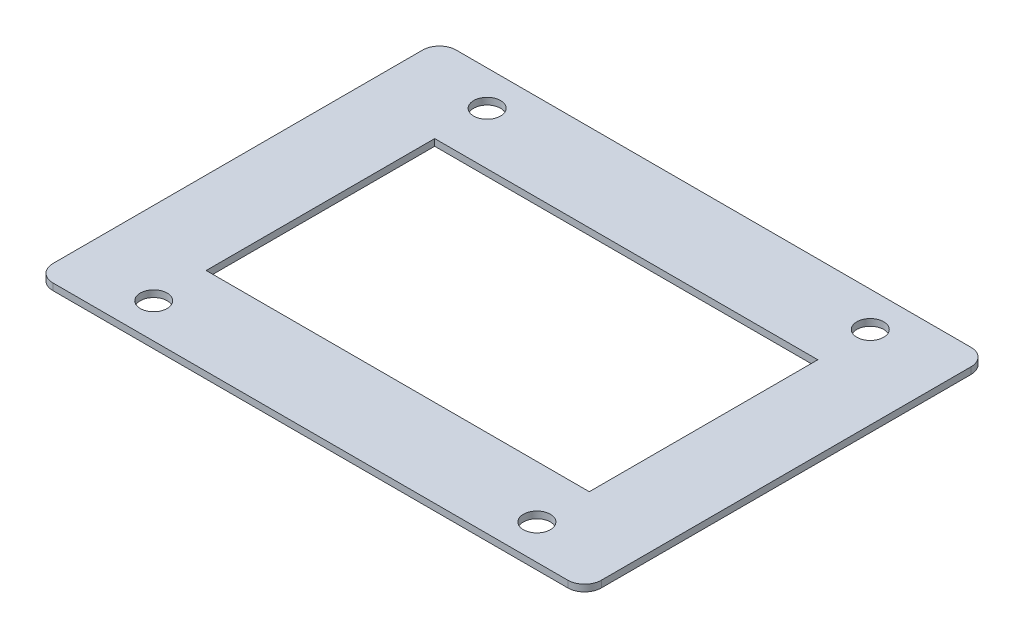
ISO-10303-21;
HEADER;
FILE_DESCRIPTION(('STEP AP214'),'2;1');
FILE_NAME('part.step','',(''),(''),'','','');
FILE_SCHEMA(('AUTOMOTIVE_DESIGN { 1 0 10303 214 1 1 1 1 }'));
ENDSEC;
DATA;
#1=APPLICATION_CONTEXT('core data for automotive mechanical design processes');
#2=APPLICATION_PROTOCOL_DEFINITION('international standard','automotive_design',2000,#1);
#3=PRODUCT_CONTEXT('',#1,'mechanical');
#4=PRODUCT('Part','Part','',(#3));
#5=PRODUCT_RELATED_PRODUCT_CATEGORY('part','',(#4));
#6=PRODUCT_DEFINITION_FORMATION('','',#4);
#7=PRODUCT_DEFINITION_CONTEXT('part definition',#1,'design');
#8=PRODUCT_DEFINITION('design','',#6,#7);
#9=PRODUCT_DEFINITION_SHAPE('','',#8);
#10=(LENGTH_UNIT() NAMED_UNIT(*) SI_UNIT(.MILLI.,.METRE.));
#11=(NAMED_UNIT(*) PLANE_ANGLE_UNIT() SI_UNIT($,.RADIAN.));
#12=(NAMED_UNIT(*) SI_UNIT($,.STERADIAN.) SOLID_ANGLE_UNIT());
#13=UNCERTAINTY_MEASURE_WITH_UNIT(LENGTH_MEASURE(1.E-05),#10,'distance_accuracy_value','');
#14=(GEOMETRIC_REPRESENTATION_CONTEXT(3) GLOBAL_UNCERTAINTY_ASSIGNED_CONTEXT((#13)) GLOBAL_UNIT_ASSIGNED_CONTEXT((#10,
#11,#12)) REPRESENTATION_CONTEXT('',''));
#15=CARTESIAN_POINT('',(0.,0.,0.));
#16=DIRECTION('',(0.,0.,1.));
#17=DIRECTION('',(1.,0.,0.));
#18=AXIS2_PLACEMENT_3D('',#15,#16,#17);
#19=CARTESIAN_POINT('',(38.3,1.,-27.5));
#20=DIRECTION('',(0.,1.,0.));
#21=DIRECTION('',(0.,0.,1.));
#22=AXIS2_PLACEMENT_3D('',#19,#20,#21);
#23=PLANE('',#22);
#24=CARTESIAN_POINT('',(-28.5,1.,-24.8));
#25=DIRECTION('',(0.,1.,0.));
#26=DIRECTION('',(0.,0.,1.));
#27=AXIS2_PLACEMENT_3D('',#24,#25,#26);
#28=CIRCLE('',#27,2.);
#29=CARTESIAN_POINT('',(-28.5,1.,-22.8));
#30=VERTEX_POINT('',#29);
#31=EDGE_CURVE('E163',#30,#30,#28,.T.);
#32=ORIENTED_EDGE('',*,*,#31,.F.);
#33=EDGE_LOOP('',(#32));
#34=FACE_BOUND('',#33,.T.);
#35=CARTESIAN_POINT('',(28.5,1.,24.8));
#36=DIRECTION('',(0.,1.,0.));
#37=DIRECTION('',(0.,0.,1.));
#38=AXIS2_PLACEMENT_3D('',#35,#36,#37);
#39=CIRCLE('',#38,2.);
#40=CARTESIAN_POINT('',(28.5,1.,26.8));
#41=VERTEX_POINT('',#40);
#42=EDGE_CURVE('E175',#41,#41,#39,.T.);
#43=ORIENTED_EDGE('',*,*,#42,.F.);
#44=EDGE_LOOP('',(#43));
#45=FACE_BOUND('',#44,.T.);
#46=CARTESIAN_POINT('',(38.3,1.,-27.5));
#47=DIRECTION('',(0.,1.,0.));
#48=DIRECTION('',(0.,0.,1.));
#49=AXIS2_PLACEMENT_3D('',#46,#47,#48);
#50=CIRCLE('',#49,2.5);
#51=CARTESIAN_POINT('',(40.8,1.,-27.5));
#52=VERTEX_POINT('',#51);
#53=CARTESIAN_POINT('',(38.3,1.,-30.));
#54=VERTEX_POINT('',#53);
#55=EDGE_CURVE('E181',#52,#54,#50,.T.);
#56=ORIENTED_EDGE('',*,*,#55,.T.);
#57=DIRECTION('',(-1.,0.,0.));
#58=VECTOR('',#57,1.);
#59=CARTESIAN_POINT('',(-38.3,1.,-30.));
#60=LINE('',#59,#58);
#61=CARTESIAN_POINT('',(-38.3,1.,-30.));
#62=VERTEX_POINT('',#61);
#63=EDGE_CURVE('E184',#54,#62,#60,.T.);
#64=ORIENTED_EDGE('',*,*,#63,.T.);
#65=CARTESIAN_POINT('',(-38.3,1.,-27.5));
#66=DIRECTION('',(0.,1.,0.));
#67=DIRECTION('',(0.,0.,1.));
#68=AXIS2_PLACEMENT_3D('',#65,#66,#67);
#69=CIRCLE('',#68,2.5);
#70=CARTESIAN_POINT('',(-40.8,1.,-27.5));
#71=VERTEX_POINT('',#70);
#72=EDGE_CURVE('E187',#62,#71,#69,.T.);
#73=ORIENTED_EDGE('',*,*,#72,.T.);
#74=DIRECTION('',(0.,0.,1.));
#75=VECTOR('',#74,1.);
#76=CARTESIAN_POINT('',(-40.8,1.,27.5));
#77=LINE('',#76,#75);
#78=CARTESIAN_POINT('',(-40.8,1.,27.5));
#79=VERTEX_POINT('',#78);
#80=EDGE_CURVE('E189',#71,#79,#77,.T.);
#81=ORIENTED_EDGE('',*,*,#80,.T.);
#82=CARTESIAN_POINT('',(-38.3,1.,27.5));
#83=DIRECTION('',(0.,1.,0.));
#84=DIRECTION('',(0.,0.,1.));
#85=AXIS2_PLACEMENT_3D('',#82,#83,#84);
#86=CIRCLE('',#85,2.5);
#87=CARTESIAN_POINT('',(-38.3,1.,30.));
#88=VERTEX_POINT('',#87);
#89=EDGE_CURVE('E191',#79,#88,#86,.T.);
#90=ORIENTED_EDGE('',*,*,#89,.T.);
#91=DIRECTION('',(1.,0.,0.));
#92=VECTOR('',#91,1.);
#93=CARTESIAN_POINT('',(38.3,1.,30.));
#94=LINE('',#93,#92);
#95=CARTESIAN_POINT('',(38.3,1.,30.));
#96=VERTEX_POINT('',#95);
#97=EDGE_CURVE('E193',#88,#96,#94,.T.);
#98=ORIENTED_EDGE('',*,*,#97,.T.);
#99=CARTESIAN_POINT('',(38.3,1.,27.5));
#100=DIRECTION('',(0.,1.,0.));
#101=DIRECTION('',(0.,0.,1.));
#102=AXIS2_PLACEMENT_3D('',#99,#100,#101);
#103=CIRCLE('',#102,2.5);
#104=CARTESIAN_POINT('',(40.8,1.,27.5));
#105=VERTEX_POINT('',#104);
#106=EDGE_CURVE('E195',#96,#105,#103,.T.);
#107=ORIENTED_EDGE('',*,*,#106,.T.);
#108=DIRECTION('',(0.,0.,-1.));
#109=VECTOR('',#108,1.);
#110=CARTESIAN_POINT('',(40.8,1.,-27.5));
#111=LINE('',#110,#109);
#112=EDGE_CURVE('E197',#105,#52,#111,.T.);
#113=ORIENTED_EDGE('',*,*,#112,.T.);
#114=EDGE_LOOP('',(#56,#64,#73,#81,#90,#98,#107,#113));
#115=FACE_BOUND('',#114,.T.);
#116=CARTESIAN_POINT('',(28.5,1.,-24.8));
#117=DIRECTION('',(0.,1.,0.));
#118=DIRECTION('',(0.,0.,1.));
#119=AXIS2_PLACEMENT_3D('',#116,#117,#118);
#120=CIRCLE('',#119,2.);
#121=CARTESIAN_POINT('',(28.5,1.,-22.8));
#122=VERTEX_POINT('',#121);
#123=EDGE_CURVE('E169',#122,#122,#120,.T.);
#124=ORIENTED_EDGE('',*,*,#123,.F.);
#125=EDGE_LOOP('',(#124));
#126=FACE_BOUND('',#125,.T.);
#127=CARTESIAN_POINT('',(-28.5,1.,24.8));
#128=DIRECTION('',(0.,1.,0.));
#129=DIRECTION('',(0.,0.,1.));
#130=AXIS2_PLACEMENT_3D('',#127,#128,#129);
#131=CIRCLE('',#130,2.);
#132=CARTESIAN_POINT('',(-28.5,1.,26.8));
#133=VERTEX_POINT('',#132);
#134=EDGE_CURVE('E157',#133,#133,#131,.T.);
#135=ORIENTED_EDGE('',*,*,#134,.F.);
#136=EDGE_LOOP('',(#135));
#137=FACE_BOUND('',#136,.T.);
#138=DIRECTION('',(-1.,0.,0.));
#139=VECTOR('',#138,1.);
#140=CARTESIAN_POINT('',(-28.5,1.,-17.));
#141=LINE('',#140,#139);
#142=CARTESIAN_POINT('',(28.5,1.,-17.));
#143=VERTEX_POINT('',#142);
#144=CARTESIAN_POINT('',(-28.5,1.,-17.));
#145=VERTEX_POINT('',#144);
#146=EDGE_CURVE('E140',#143,#145,#141,.T.);
#147=ORIENTED_EDGE('',*,*,#146,.F.);
#148=DIRECTION('',(0.,0.,-1.));
#149=VECTOR('',#148,1.);
#150=CARTESIAN_POINT('',(28.5,1.,-17.));
#151=LINE('',#150,#149);
#152=CARTESIAN_POINT('',(28.5,1.,17.));
#153=VERTEX_POINT('',#152);
#154=EDGE_CURVE('E124',#153,#143,#151,.T.);
#155=ORIENTED_EDGE('',*,*,#154,.F.);
#156=DIRECTION('',(1.,0.,0.));
#157=VECTOR('',#156,1.);
#158=CARTESIAN_POINT('',(-28.5,1.,17.));
#159=LINE('',#158,#157);
#160=CARTESIAN_POINT('',(-28.5,1.,17.));
#161=VERTEX_POINT('',#160);
#162=EDGE_CURVE('E133',#161,#153,#159,.T.);
#163=ORIENTED_EDGE('',*,*,#162,.F.);
#164=DIRECTION('',(0.,0.,1.));
#165=VECTOR('',#164,1.);
#166=CARTESIAN_POINT('',(-28.5,1.,4.));
#167=LINE('',#166,#165);
#168=EDGE_CURVE('E48',#145,#161,#167,.T.);
#169=ORIENTED_EDGE('',*,*,#168,.F.);
#170=EDGE_LOOP('',(#147,#155,#163,#169));
#171=FACE_BOUND('',#170,.T.);
#172=ADVANCED_FACE('F33',(#34,#45,#115,#126,#137,#171),#23,.T.);
#173=CARTESIAN_POINT('',(38.3,0.,-27.5));
#174=DIRECTION('',(0.,1.,0.));
#175=DIRECTION('',(0.,0.,1.));
#176=AXIS2_PLACEMENT_3D('',#173,#174,#175);
#177=PLANE('',#176);
#178=CARTESIAN_POINT('',(-28.5,0.,24.8));
#179=DIRECTION('',(0.,1.,0.));
#180=DIRECTION('',(0.,0.,1.));
#181=AXIS2_PLACEMENT_3D('',#178,#179,#180);
#182=CIRCLE('',#181,2.);
#183=CARTESIAN_POINT('',(-28.5,0.,26.8));
#184=VERTEX_POINT('',#183);
#185=EDGE_CURVE('E136',#184,#184,#182,.T.);
#186=ORIENTED_EDGE('',*,*,#185,.T.);
#187=EDGE_LOOP('',(#186));
#188=FACE_BOUND('',#187,.T.);
#189=CARTESIAN_POINT('',(-28.5,0.,-24.8));
#190=DIRECTION('',(0.,1.,0.));
#191=DIRECTION('',(0.,0.,1.));
#192=AXIS2_PLACEMENT_3D('',#189,#190,#191);
#193=CIRCLE('',#192,2.);
#194=CARTESIAN_POINT('',(-28.5,0.,-22.8));
#195=VERTEX_POINT('',#194);
#196=EDGE_CURVE('E160',#195,#195,#193,.T.);
#197=ORIENTED_EDGE('',*,*,#196,.T.);
#198=EDGE_LOOP('',(#197));
#199=FACE_BOUND('',#198,.T.);
#200=CARTESIAN_POINT('',(28.5,0.,-24.8));
#201=DIRECTION('',(0.,1.,0.));
#202=DIRECTION('',(0.,0.,1.));
#203=AXIS2_PLACEMENT_3D('',#200,#201,#202);
#204=CIRCLE('',#203,2.);
#205=CARTESIAN_POINT('',(28.5,0.,-22.8));
#206=VERTEX_POINT('',#205);
#207=EDGE_CURVE('E166',#206,#206,#204,.T.);
#208=ORIENTED_EDGE('',*,*,#207,.T.);
#209=EDGE_LOOP('',(#208));
#210=FACE_BOUND('',#209,.T.);
#211=CARTESIAN_POINT('',(28.5,0.,24.8));
#212=DIRECTION('',(0.,1.,0.));
#213=DIRECTION('',(0.,0.,1.));
#214=AXIS2_PLACEMENT_3D('',#211,#212,#213);
#215=CIRCLE('',#214,2.);
#216=CARTESIAN_POINT('',(28.5,0.,26.8));
#217=VERTEX_POINT('',#216);
#218=EDGE_CURVE('E172',#217,#217,#215,.T.);
#219=ORIENTED_EDGE('',*,*,#218,.T.);
#220=EDGE_LOOP('',(#219));
#221=FACE_BOUND('',#220,.T.);
#222=CARTESIAN_POINT('',(38.3,0.,-27.5));
#223=DIRECTION('',(0.,1.,0.));
#224=DIRECTION('',(0.,0.,1.));
#225=AXIS2_PLACEMENT_3D('',#222,#223,#224);
#226=CIRCLE('',#225,2.5);
#227=CARTESIAN_POINT('',(40.8,0.,-27.5));
#228=VERTEX_POINT('',#227);
#229=CARTESIAN_POINT('',(38.3,0.,-30.));
#230=VERTEX_POINT('',#229);
#231=EDGE_CURVE('E178',#228,#230,#226,.T.);
#232=ORIENTED_EDGE('',*,*,#231,.F.);
#233=DIRECTION('',(0.,0.,-1.));
#234=VECTOR('',#233,1.);
#235=CARTESIAN_POINT('',(40.8,0.,-27.5));
#236=LINE('',#235,#234);
#237=CARTESIAN_POINT('',(40.8,0.,27.5));
#238=VERTEX_POINT('',#237);
#239=EDGE_CURVE('E185',#238,#228,#236,.T.);
#240=ORIENTED_EDGE('',*,*,#239,.F.);
#241=CARTESIAN_POINT('',(38.3,0.,27.5));
#242=DIRECTION('',(0.,1.,0.));
#243=DIRECTION('',(0.,0.,1.));
#244=AXIS2_PLACEMENT_3D('',#241,#242,#243);
#245=CIRCLE('',#244,2.5);
#246=CARTESIAN_POINT('',(38.3,0.,30.));
#247=VERTEX_POINT('',#246);
#248=EDGE_CURVE('E212',#247,#238,#245,.T.);
#249=ORIENTED_EDGE('',*,*,#248,.F.);
#250=DIRECTION('',(1.,0.,0.));
#251=VECTOR('',#250,1.);
#252=CARTESIAN_POINT('',(38.3,0.,30.));
#253=LINE('',#252,#251);
#254=CARTESIAN_POINT('',(-38.3,0.,30.));
#255=VERTEX_POINT('',#254);
#256=EDGE_CURVE('E210',#255,#247,#253,.T.);
#257=ORIENTED_EDGE('',*,*,#256,.F.);
#258=CARTESIAN_POINT('',(-38.3,0.,27.5));
#259=DIRECTION('',(0.,1.,0.));
#260=DIRECTION('',(0.,0.,1.));
#261=AXIS2_PLACEMENT_3D('',#258,#259,#260);
#262=CIRCLE('',#261,2.5);
#263=CARTESIAN_POINT('',(-40.8,0.,27.5));
#264=VERTEX_POINT('',#263);
#265=EDGE_CURVE('E208',#264,#255,#262,.T.);
#266=ORIENTED_EDGE('',*,*,#265,.F.);
#267=DIRECTION('',(0.,0.,1.));
#268=VECTOR('',#267,1.);
#269=CARTESIAN_POINT('',(-40.8,0.,27.5));
#270=LINE('',#269,#268);
#271=CARTESIAN_POINT('',(-40.8,0.,-27.5));
#272=VERTEX_POINT('',#271);
#273=EDGE_CURVE('E206',#272,#264,#270,.T.);
#274=ORIENTED_EDGE('',*,*,#273,.F.);
#275=CARTESIAN_POINT('',(-38.3,0.,-27.5));
#276=DIRECTION('',(0.,1.,0.));
#277=DIRECTION('',(0.,0.,1.));
#278=AXIS2_PLACEMENT_3D('',#275,#276,#277);
#279=CIRCLE('',#278,2.5);
#280=CARTESIAN_POINT('',(-38.3,0.,-30.));
#281=VERTEX_POINT('',#280);
#282=EDGE_CURVE('E204',#281,#272,#279,.T.);
#283=ORIENTED_EDGE('',*,*,#282,.F.);
#284=DIRECTION('',(-1.,0.,0.));
#285=VECTOR('',#284,1.);
#286=CARTESIAN_POINT('',(-38.3,0.,-30.));
#287=LINE('',#286,#285);
#288=EDGE_CURVE('E202',#230,#281,#287,.T.);
#289=ORIENTED_EDGE('',*,*,#288,.F.);
#290=EDGE_LOOP('',(#232,#240,#249,#257,#266,#274,#283,#289));
#291=FACE_BOUND('',#290,.T.);
#292=DIRECTION('',(0.,0.,-1.));
#293=VECTOR('',#292,1.);
#294=CARTESIAN_POINT('',(28.5,0.,-17.));
#295=LINE('',#294,#293);
#296=CARTESIAN_POINT('',(28.5,0.,17.));
#297=VERTEX_POINT('',#296);
#298=CARTESIAN_POINT('',(28.5,0.,-17.));
#299=VERTEX_POINT('',#298);
#300=EDGE_CURVE('E56',#297,#299,#295,.T.);
#301=ORIENTED_EDGE('',*,*,#300,.T.);
#302=DIRECTION('',(-1.,0.,0.));
#303=VECTOR('',#302,1.);
#304=CARTESIAN_POINT('',(-28.5,0.,-17.));
#305=LINE('',#304,#303);
#306=CARTESIAN_POINT('',(-28.5,0.,-17.));
#307=VERTEX_POINT('',#306);
#308=EDGE_CURVE('E142',#299,#307,#305,.T.);
#309=ORIENTED_EDGE('',*,*,#308,.T.);
#310=DIRECTION('',(0.,0.,1.));
#311=VECTOR('',#310,1.);
#312=CARTESIAN_POINT('',(-28.5,0.,4.));
#313=LINE('',#312,#311);
#314=CARTESIAN_POINT('',(-28.5,0.,17.));
#315=VERTEX_POINT('',#314);
#316=EDGE_CURVE('E149',#307,#315,#313,.T.);
#317=ORIENTED_EDGE('',*,*,#316,.T.);
#318=DIRECTION('',(1.,0.,0.));
#319=VECTOR('',#318,1.);
#320=CARTESIAN_POINT('',(-28.5,0.,17.));
#321=LINE('',#320,#319);
#322=EDGE_CURVE('E130',#315,#297,#321,.T.);
#323=ORIENTED_EDGE('',*,*,#322,.T.);
#324=EDGE_LOOP('',(#301,#309,#317,#323));
#325=FACE_BOUND('',#324,.T.);
#326=ADVANCED_FACE('F242',(#188,#199,#210,#221,#291,#325),#177,.F.);
#327=CARTESIAN_POINT('',(38.3,1.,-27.5));
#328=DIRECTION('',(0.,-1.,0.));
#329=DIRECTION('',(0.,0.,-1.));
#330=AXIS2_PLACEMENT_3D('',#327,#328,#329);
#331=CYLINDRICAL_SURFACE('',#330,2.5);
#332=ORIENTED_EDGE('',*,*,#231,.T.);
#333=DIRECTION('',(0.,-1.,0.));
#334=VECTOR('',#333,1.);
#335=CARTESIAN_POINT('',(38.3,1.,-30.));
#336=LINE('',#335,#334);
#337=EDGE_CURVE('E11',#54,#230,#336,.T.);
#338=ORIENTED_EDGE('',*,*,#337,.F.);
#339=ORIENTED_EDGE('',*,*,#55,.F.);
#340=DIRECTION('',(0.,-1.,0.));
#341=VECTOR('',#340,1.);
#342=CARTESIAN_POINT('',(40.8,1.,-27.5));
#343=LINE('',#342,#341);
#344=EDGE_CURVE('E199',#52,#228,#343,.T.);
#345=ORIENTED_EDGE('',*,*,#344,.T.);
#346=EDGE_LOOP('',(#332,#338,#339,#345));
#347=FACE_BOUND('',#346,.T.);
#348=ADVANCED_FACE('F35',(#347),#331,.T.);
#349=CARTESIAN_POINT('',(-38.3,1.,-30.));
#350=DIRECTION('',(0.,0.,1.));
#351=DIRECTION('',(1.,0.,0.));
#352=AXIS2_PLACEMENT_3D('',#349,#350,#351);
#353=PLANE('',#352);
#354=ORIENTED_EDGE('',*,*,#288,.T.);
#355=DIRECTION('',(0.,-1.,0.));
#356=VECTOR('',#355,1.);
#357=CARTESIAN_POINT('',(-38.3,1.,-30.));
#358=LINE('',#357,#356);
#359=EDGE_CURVE('E41',#62,#281,#358,.T.);
#360=ORIENTED_EDGE('',*,*,#359,.F.);
#361=ORIENTED_EDGE('',*,*,#63,.F.);
#362=ORIENTED_EDGE('',*,*,#337,.T.);
#363=EDGE_LOOP('',(#354,#360,#361,#362));
#364=FACE_BOUND('',#363,.T.);
#365=ADVANCED_FACE('F260',(#364),#353,.F.);
#366=CARTESIAN_POINT('',(-38.3,1.,-27.5));
#367=DIRECTION('',(0.,-1.,0.));
#368=DIRECTION('',(0.,0.,-1.));
#369=AXIS2_PLACEMENT_3D('',#366,#367,#368);
#370=CYLINDRICAL_SURFACE('',#369,2.5);
#371=ORIENTED_EDGE('',*,*,#282,.T.);
#372=DIRECTION('',(0.,-1.,0.));
#373=VECTOR('',#372,1.);
#374=CARTESIAN_POINT('',(-40.8,1.,-27.5));
#375=LINE('',#374,#373);
#376=EDGE_CURVE('E229',#71,#272,#375,.T.);
#377=ORIENTED_EDGE('',*,*,#376,.F.);
#378=ORIENTED_EDGE('',*,*,#72,.F.);
#379=ORIENTED_EDGE('',*,*,#359,.T.);
#380=EDGE_LOOP('',(#371,#377,#378,#379));
#381=FACE_BOUND('',#380,.T.);
#382=ADVANCED_FACE('F236',(#381),#370,.T.);
#383=CARTESIAN_POINT('',(-40.8,1.,27.5));
#384=DIRECTION('',(1.,0.,0.));
#385=DIRECTION('',(0.,0.,-1.));
#386=AXIS2_PLACEMENT_3D('',#383,#384,#385);
#387=PLANE('',#386);
#388=ORIENTED_EDGE('',*,*,#273,.T.);
#389=DIRECTION('',(0.,-1.,0.));
#390=VECTOR('',#389,1.);
#391=CARTESIAN_POINT('',(-40.8,1.,27.5));
#392=LINE('',#391,#390);
#393=EDGE_CURVE('E226',#79,#264,#392,.T.);
#394=ORIENTED_EDGE('',*,*,#393,.F.);
#395=ORIENTED_EDGE('',*,*,#80,.F.);
#396=ORIENTED_EDGE('',*,*,#376,.T.);
#397=EDGE_LOOP('',(#388,#394,#395,#396));
#398=FACE_BOUND('',#397,.T.);
#399=ADVANCED_FACE('F248',(#398),#387,.F.);
#400=CARTESIAN_POINT('',(-38.3,1.,27.5));
#401=DIRECTION('',(0.,-1.,0.));
#402=DIRECTION('',(0.,0.,-1.));
#403=AXIS2_PLACEMENT_3D('',#400,#401,#402);
#404=CYLINDRICAL_SURFACE('',#403,2.5);
#405=ORIENTED_EDGE('',*,*,#265,.T.);
#406=DIRECTION('',(0.,-1.,0.));
#407=VECTOR('',#406,1.);
#408=CARTESIAN_POINT('',(-38.3,1.,30.));
#409=LINE('',#408,#407);
#410=EDGE_CURVE('E223',#88,#255,#409,.T.);
#411=ORIENTED_EDGE('',*,*,#410,.F.);
#412=ORIENTED_EDGE('',*,*,#89,.F.);
#413=ORIENTED_EDGE('',*,*,#393,.T.);
#414=EDGE_LOOP('',(#405,#411,#412,#413));
#415=FACE_BOUND('',#414,.T.);
#416=ADVANCED_FACE('F252',(#415),#404,.T.);
#417=CARTESIAN_POINT('',(38.3,1.,30.));
#418=DIRECTION('',(0.,0.,-1.));
#419=DIRECTION('',(-1.,0.,0.));
#420=AXIS2_PLACEMENT_3D('',#417,#418,#419);
#421=PLANE('',#420);
#422=ORIENTED_EDGE('',*,*,#256,.T.);
#423=DIRECTION('',(0.,-1.,0.));
#424=VECTOR('',#423,1.);
#425=CARTESIAN_POINT('',(38.3,1.,30.));
#426=LINE('',#425,#424);
#427=EDGE_CURVE('E220',#96,#247,#426,.T.);
#428=ORIENTED_EDGE('',*,*,#427,.F.);
#429=ORIENTED_EDGE('',*,*,#97,.F.);
#430=ORIENTED_EDGE('',*,*,#410,.T.);
#431=EDGE_LOOP('',(#422,#428,#429,#430));
#432=FACE_BOUND('',#431,.T.);
#433=ADVANCED_FACE('F273',(#432),#421,.F.);
#434=CARTESIAN_POINT('',(38.3,1.,27.5));
#435=DIRECTION('',(0.,-1.,0.));
#436=DIRECTION('',(0.,0.,-1.));
#437=AXIS2_PLACEMENT_3D('',#434,#435,#436);
#438=CYLINDRICAL_SURFACE('',#437,2.5);
#439=ORIENTED_EDGE('',*,*,#248,.T.);
#440=DIRECTION('',(0.,-1.,0.));
#441=VECTOR('',#440,1.);
#442=CARTESIAN_POINT('',(40.8,1.,27.5));
#443=LINE('',#442,#441);
#444=EDGE_CURVE('E217',#105,#238,#443,.T.);
#445=ORIENTED_EDGE('',*,*,#444,.F.);
#446=ORIENTED_EDGE('',*,*,#106,.F.);
#447=ORIENTED_EDGE('',*,*,#427,.T.);
#448=EDGE_LOOP('',(#439,#445,#446,#447));
#449=FACE_BOUND('',#448,.T.);
#450=ADVANCED_FACE('F271',(#449),#438,.T.);
#451=CARTESIAN_POINT('',(40.8,1.,-27.5));
#452=DIRECTION('',(-1.,0.,0.));
#453=DIRECTION('',(0.,0.,1.));
#454=AXIS2_PLACEMENT_3D('',#451,#452,#453);
#455=PLANE('',#454);
#456=ORIENTED_EDGE('',*,*,#239,.T.);
#457=ORIENTED_EDGE('',*,*,#344,.F.);
#458=ORIENTED_EDGE('',*,*,#112,.F.);
#459=ORIENTED_EDGE('',*,*,#444,.T.);
#460=EDGE_LOOP('',(#456,#457,#458,#459));
#461=FACE_BOUND('',#460,.T.);
#462=ADVANCED_FACE('F266',(#461),#455,.F.);
#463=CARTESIAN_POINT('',(28.5,1.,24.8));
#464=DIRECTION('',(0.,-1.,0.));
#465=DIRECTION('',(0.,0.,-1.));
#466=AXIS2_PLACEMENT_3D('',#463,#464,#465);
#467=CYLINDRICAL_SURFACE('',#466,2.);
#468=ORIENTED_EDGE('',*,*,#42,.T.);
#469=EDGE_LOOP('',(#468));
#470=FACE_BOUND('',#469,.T.);
#471=ORIENTED_EDGE('',*,*,#218,.F.);
#472=EDGE_LOOP('',(#471));
#473=FACE_BOUND('',#472,.T.);
#474=ADVANCED_FACE('F293',(#470,#473),#467,.F.);
#475=CARTESIAN_POINT('',(28.5,1.,-24.8));
#476=DIRECTION('',(0.,-1.,0.));
#477=DIRECTION('',(0.,0.,-1.));
#478=AXIS2_PLACEMENT_3D('',#475,#476,#477);
#479=CYLINDRICAL_SURFACE('',#478,2.);
#480=ORIENTED_EDGE('',*,*,#123,.T.);
#481=EDGE_LOOP('',(#480));
#482=FACE_BOUND('',#481,.T.);
#483=ORIENTED_EDGE('',*,*,#207,.F.);
#484=EDGE_LOOP('',(#483));
#485=FACE_BOUND('',#484,.T.);
#486=ADVANCED_FACE('F300',(#482,#485),#479,.F.);
#487=CARTESIAN_POINT('',(-28.5,1.,-24.8));
#488=DIRECTION('',(0.,-1.,0.));
#489=DIRECTION('',(0.,0.,-1.));
#490=AXIS2_PLACEMENT_3D('',#487,#488,#489);
#491=CYLINDRICAL_SURFACE('',#490,2.);
#492=ORIENTED_EDGE('',*,*,#31,.T.);
#493=EDGE_LOOP('',(#492));
#494=FACE_BOUND('',#493,.T.);
#495=ORIENTED_EDGE('',*,*,#196,.F.);
#496=EDGE_LOOP('',(#495));
#497=FACE_BOUND('',#496,.T.);
#498=ADVANCED_FACE('F305',(#494,#497),#491,.F.);
#499=CARTESIAN_POINT('',(-28.5,1.,24.8));
#500=DIRECTION('',(0.,-1.,0.));
#501=DIRECTION('',(0.,0.,-1.));
#502=AXIS2_PLACEMENT_3D('',#499,#500,#501);
#503=CYLINDRICAL_SURFACE('',#502,2.);
#504=ORIENTED_EDGE('',*,*,#134,.T.);
#505=EDGE_LOOP('',(#504));
#506=FACE_BOUND('',#505,.T.);
#507=ORIENTED_EDGE('',*,*,#185,.F.);
#508=EDGE_LOOP('',(#507));
#509=FACE_BOUND('',#508,.T.);
#510=ADVANCED_FACE('F314',(#506,#509),#503,.F.);
#511=CARTESIAN_POINT('',(28.5,1.001,-17.));
#512=DIRECTION('',(-1.,0.,0.));
#513=DIRECTION('',(0.,0.,1.));
#514=AXIS2_PLACEMENT_3D('',#511,#512,#513);
#515=PLANE('',#514);
#516=ORIENTED_EDGE('',*,*,#154,.T.);
#517=DIRECTION('',(0.,-1.,0.));
#518=VECTOR('',#517,1.);
#519=CARTESIAN_POINT('',(28.5,1.001,-17.));
#520=LINE('',#519,#518);
#521=EDGE_CURVE('E137',#143,#299,#520,.T.);
#522=ORIENTED_EDGE('',*,*,#521,.T.);
#523=ORIENTED_EDGE('',*,*,#300,.F.);
#524=DIRECTION('',(0.,-1.,0.));
#525=VECTOR('',#524,1.);
#526=CARTESIAN_POINT('',(28.5,1.001,17.));
#527=LINE('',#526,#525);
#528=EDGE_CURVE('E120',#153,#297,#527,.T.);
#529=ORIENTED_EDGE('',*,*,#528,.F.);
#530=EDGE_LOOP('',(#516,#522,#523,#529));
#531=FACE_BOUND('',#530,.T.);
#532=ADVANCED_FACE('F122',(#531),#515,.T.);
#533=CARTESIAN_POINT('',(-28.5,1.001,-17.));
#534=DIRECTION('',(0.,0.,1.));
#535=DIRECTION('',(1.,0.,0.));
#536=AXIS2_PLACEMENT_3D('',#533,#534,#535);
#537=PLANE('',#536);
#538=ORIENTED_EDGE('',*,*,#146,.T.);
#539=DIRECTION('',(0.,-1.,0.));
#540=VECTOR('',#539,1.);
#541=CARTESIAN_POINT('',(-28.5,1.001,-17.));
#542=LINE('',#541,#540);
#543=EDGE_CURVE('E154',#145,#307,#542,.T.);
#544=ORIENTED_EDGE('',*,*,#543,.T.);
#545=ORIENTED_EDGE('',*,*,#308,.F.);
#546=ORIENTED_EDGE('',*,*,#521,.F.);
#547=EDGE_LOOP('',(#538,#544,#545,#546));
#548=FACE_BOUND('',#547,.T.);
#549=ADVANCED_FACE('F324',(#548),#537,.T.);
#550=CARTESIAN_POINT('',(-28.5,1.001,4.));
#551=DIRECTION('',(1.,0.,0.));
#552=DIRECTION('',(0.,0.,-1.));
#553=AXIS2_PLACEMENT_3D('',#550,#551,#552);
#554=PLANE('',#553);
#555=ORIENTED_EDGE('',*,*,#168,.T.);
#556=DIRECTION('',(0.,-1.,0.));
#557=VECTOR('',#556,1.);
#558=CARTESIAN_POINT('',(-28.5,1.001,17.));
#559=LINE('',#558,#557);
#560=EDGE_CURVE('E129',#161,#315,#559,.T.);
#561=ORIENTED_EDGE('',*,*,#560,.T.);
#562=ORIENTED_EDGE('',*,*,#316,.F.);
#563=ORIENTED_EDGE('',*,*,#543,.F.);
#564=EDGE_LOOP('',(#555,#561,#562,#563));
#565=FACE_BOUND('',#564,.T.);
#566=ADVANCED_FACE('F327',(#565),#554,.T.);
#567=CARTESIAN_POINT('',(-28.5,1.001,17.));
#568=DIRECTION('',(0.,0.,-1.));
#569=DIRECTION('',(-1.,0.,0.));
#570=AXIS2_PLACEMENT_3D('',#567,#568,#569);
#571=PLANE('',#570);
#572=ORIENTED_EDGE('',*,*,#162,.T.);
#573=ORIENTED_EDGE('',*,*,#528,.T.);
#574=ORIENTED_EDGE('',*,*,#322,.F.);
#575=ORIENTED_EDGE('',*,*,#560,.F.);
#576=EDGE_LOOP('',(#572,#573,#574,#575));
#577=FACE_BOUND('',#576,.T.);
#578=ADVANCED_FACE('F134',(#577),#571,.T.);
#579=CLOSED_SHELL('',(#172,#326,#348,#365,#382,#399,#416,#433,#450,#462,#474,#486,#498,#510,
#532,#549,#566,#578));
#580=MANIFOLD_SOLID_BREP('B2',#579);
#581=ADVANCED_BREP_SHAPE_REPRESENTATION('',(#18,#580),#14);
#582=SHAPE_DEFINITION_REPRESENTATION(#9,#581);
ENDSEC;
END-ISO-10303-21;
